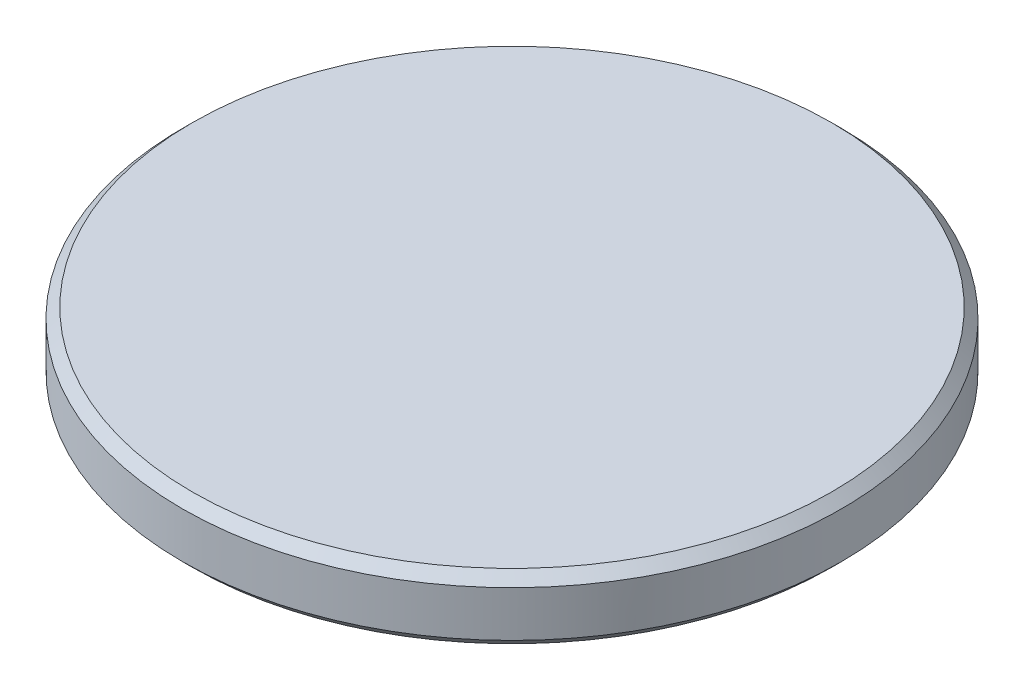
ISO-10303-21;
HEADER;
FILE_DESCRIPTION(('STEP AP214'),'2;1');
FILE_NAME('part.step','',(''),(''),'','','');
FILE_SCHEMA(('AUTOMOTIVE_DESIGN { 1 0 10303 214 1 1 1 1 }'));
ENDSEC;
DATA;
#1=APPLICATION_CONTEXT('core data for automotive mechanical design processes');
#2=APPLICATION_PROTOCOL_DEFINITION('international standard','automotive_design',2000,#1);
#3=PRODUCT_CONTEXT('',#1,'mechanical');
#4=PRODUCT('Part','Part','',(#3));
#5=PRODUCT_RELATED_PRODUCT_CATEGORY('part','',(#4));
#6=PRODUCT_DEFINITION_FORMATION('','',#4);
#7=PRODUCT_DEFINITION_CONTEXT('part definition',#1,'design');
#8=PRODUCT_DEFINITION('design','',#6,#7);
#9=PRODUCT_DEFINITION_SHAPE('','',#8);
#10=(LENGTH_UNIT() NAMED_UNIT(*) SI_UNIT(.MILLI.,.METRE.));
#11=(NAMED_UNIT(*) PLANE_ANGLE_UNIT() SI_UNIT($,.RADIAN.));
#12=(NAMED_UNIT(*) SI_UNIT($,.STERADIAN.) SOLID_ANGLE_UNIT());
#13=UNCERTAINTY_MEASURE_WITH_UNIT(LENGTH_MEASURE(1.E-05),#10,'distance_accuracy_value','');
#14=(GEOMETRIC_REPRESENTATION_CONTEXT(3) GLOBAL_UNCERTAINTY_ASSIGNED_CONTEXT((#13)) GLOBAL_UNIT_ASSIGNED_CONTEXT((#10,
#11,#12)) REPRESENTATION_CONTEXT('',''));
#15=CARTESIAN_POINT('',(0.,0.,0.));
#16=DIRECTION('',(0.,0.,1.));
#17=DIRECTION('',(1.,0.,0.));
#18=AXIS2_PLACEMENT_3D('',#15,#16,#17);
#19=CARTESIAN_POINT('',(0.,1.,0.));
#20=DIRECTION('',(0.,1.,0.));
#21=DIRECTION('',(0.,0.,1.));
#22=AXIS2_PLACEMENT_3D('',#19,#20,#21);
#23=PLANE('',#22);
#24=CARTESIAN_POINT('',(0.,0.999999999976353,0.));
#25=DIRECTION('',(0.,-1.,0.));
#26=DIRECTION('',(0.,0.,-1.));
#27=AXIS2_PLACEMENT_3D('',#24,#25,#26);
#28=CIRCLE('',#27,4.9000000000774);
#29=CARTESIAN_POINT('',(0.,0.999999999976353,-4.9000000000774));
#30=VERTEX_POINT('',#29);
#31=EDGE_CURVE('E17',#30,#30,#28,.T.);
#32=ORIENTED_EDGE('',*,*,#31,.F.);
#33=EDGE_LOOP('',(#32));
#34=FACE_BOUND('',#33,.T.);
#35=ADVANCED_FACE('F14',(#34),#23,.T.);
#36=CARTESIAN_POINT('',(0.,0.850000000014006,0.));
#37=DIRECTION('',(0.,-1.,0.));
#38=DIRECTION('',(0.,0.,-1.));
#39=AXIS2_PLACEMENT_3D('',#36,#37,#38);
#40=CONICAL_SURFACE('',#39,5.05000000003974,0.785398163397448);
#41=CARTESIAN_POINT('',(0.,0.85,0.));
#42=DIRECTION('',(0.,1.,0.));
#43=DIRECTION('',(0.,0.,1.));
#44=AXIS2_PLACEMENT_3D('',#41,#42,#43);
#45=CIRCLE('',#44,5.05);
#46=CARTESIAN_POINT('',(0.,0.85,5.05));
#47=VERTEX_POINT('',#46);
#48=EDGE_CURVE('E25',#47,#47,#45,.F.);
#49=ORIENTED_EDGE('',*,*,#48,.F.);
#50=EDGE_LOOP('',(#49));
#51=FACE_BOUND('',#50,.T.);
#52=ORIENTED_EDGE('',*,*,#31,.T.);
#53=EDGE_LOOP('',(#52));
#54=FACE_BOUND('',#53,.T.);
#55=ADVANCED_FACE('F34',(#51,#54),#40,.T.);
#56=CARTESIAN_POINT('',(0.,0.,0.));
#57=DIRECTION('',(0.,1.,0.));
#58=DIRECTION('',(0.,0.,1.));
#59=AXIS2_PLACEMENT_3D('',#56,#57,#58);
#60=CYLINDRICAL_SURFACE('',#59,5.05);
#61=ORIENTED_EDGE('',*,*,#48,.T.);
#62=EDGE_LOOP('',(#61));
#63=FACE_BOUND('',#62,.T.);
#64=CARTESIAN_POINT('',(0.,0.15000000001919,0.));
#65=DIRECTION('',(0.,1.,0.));
#66=DIRECTION('',(1.,0.,0.));
#67=AXIS2_PLACEMENT_3D('',#64,#65,#66);
#68=CIRCLE('',#67,5.0499999999829);
#69=CARTESIAN_POINT('',(5.0499999999829,0.15000000001919,0.));
#70=VERTEX_POINT('',#69);
#71=EDGE_CURVE('E21',#70,#70,#68,.F.);
#72=ORIENTED_EDGE('',*,*,#71,.F.);
#73=EDGE_LOOP('',(#72));
#74=FACE_BOUND('',#73,.T.);
#75=ADVANCED_FACE('F41',(#63,#74),#60,.T.);
#76=CARTESIAN_POINT('',(0.,0.149999999905504,0.));
#77=DIRECTION('',(0.,1.,0.));
#78=DIRECTION('',(0.,0.,1.));
#79=AXIS2_PLACEMENT_3D('',#76,#77,#78);
#80=CONICAL_SURFACE('',#79,5.04999999992606,0.785398163586926);
#81=ORIENTED_EDGE('',*,*,#71,.T.);
#82=EDGE_LOOP('',(#81));
#83=FACE_BOUND('',#82,.T.);
#84=CARTESIAN_POINT('',(0.,5.6843418860808E-11,0.));
#85=DIRECTION('',(0.,1.,0.));
#86=DIRECTION('',(0.,0.,1.));
#87=AXIS2_PLACEMENT_3D('',#84,#85,#86);
#88=CIRCLE('',#87,4.90000000002055);
#89=CARTESIAN_POINT('',(0.,5.6843418860808E-11,4.90000000002055));
#90=VERTEX_POINT('',#89);
#91=EDGE_CURVE('E10',#90,#90,#88,.T.);
#92=ORIENTED_EDGE('',*,*,#91,.T.);
#93=EDGE_LOOP('',(#92));
#94=FACE_BOUND('',#93,.T.);
#95=ADVANCED_FACE('F45',(#83,#94),#80,.T.);
#96=CARTESIAN_POINT('',(0.,0.,0.));
#97=DIRECTION('',(0.,1.,0.));
#98=DIRECTION('',(0.,0.,1.));
#99=AXIS2_PLACEMENT_3D('',#96,#97,#98);
#100=PLANE('',#99);
#101=ORIENTED_EDGE('',*,*,#91,.F.);
#102=EDGE_LOOP('',(#101));
#103=FACE_BOUND('',#102,.T.);
#104=ADVANCED_FACE('F43',(#103),#100,.F.);
#105=CLOSED_SHELL('',(#35,#55,#75,#95,#104));
#106=MANIFOLD_SOLID_BREP('B1',#105);
#107=ADVANCED_BREP_SHAPE_REPRESENTATION('',(#18,#106),#14);
#108=SHAPE_DEFINITION_REPRESENTATION(#9,#107);
ENDSEC;
END-ISO-10303-21;
